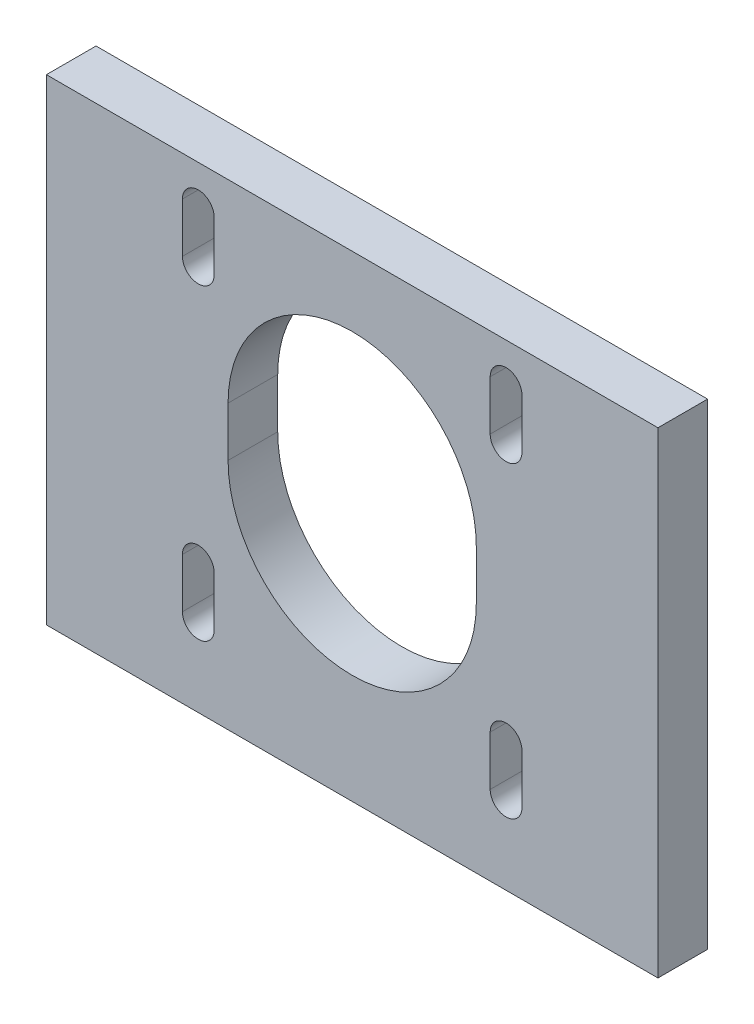
ISO-10303-21;
HEADER;
FILE_DESCRIPTION(('STEP AP214'),'2;1');
FILE_NAME('part.step','',(''),(''),'','','');
FILE_SCHEMA(('AUTOMOTIVE_DESIGN { 1 0 10303 214 1 1 1 1 }'));
ENDSEC;
DATA;
#1=APPLICATION_CONTEXT('core data for automotive mechanical design processes');
#2=APPLICATION_PROTOCOL_DEFINITION('international standard','automotive_design',2000,#1);
#3=PRODUCT_CONTEXT('',#1,'mechanical');
#4=PRODUCT('Part','Part','',(#3));
#5=PRODUCT_RELATED_PRODUCT_CATEGORY('part','',(#4));
#6=PRODUCT_DEFINITION_FORMATION('','',#4);
#7=PRODUCT_DEFINITION_CONTEXT('part definition',#1,'design');
#8=PRODUCT_DEFINITION('design','',#6,#7);
#9=PRODUCT_DEFINITION_SHAPE('','',#8);
#10=(LENGTH_UNIT() NAMED_UNIT(*) SI_UNIT(.MILLI.,.METRE.));
#11=(NAMED_UNIT(*) PLANE_ANGLE_UNIT() SI_UNIT($,.RADIAN.));
#12=(NAMED_UNIT(*) SI_UNIT($,.STERADIAN.) SOLID_ANGLE_UNIT());
#13=UNCERTAINTY_MEASURE_WITH_UNIT(LENGTH_MEASURE(1.E-05),#10,'distance_accuracy_value','');
#14=(GEOMETRIC_REPRESENTATION_CONTEXT(3) GLOBAL_UNCERTAINTY_ASSIGNED_CONTEXT((#13)) GLOBAL_UNIT_ASSIGNED_CONTEXT((#10,
#11,#12)) REPRESENTATION_CONTEXT('',''));
#15=CARTESIAN_POINT('',(0.,0.,0.));
#16=DIRECTION('',(0.,0.,1.));
#17=DIRECTION('',(1.,0.,0.));
#18=AXIS2_PLACEMENT_3D('',#15,#16,#17);
#19=CARTESIAN_POINT('',(30.8,10.,5.));
#20=DIRECTION('',(-1.,0.,0.));
#21=DIRECTION('',(0.,0.,1.));
#22=AXIS2_PLACEMENT_3D('',#19,#20,#21);
#23=PLANE('',#22);
#24=DIRECTION('',(0.,1.,0.));
#25=VECTOR('',#24,1.);
#26=CARTESIAN_POINT('',(30.8,10.,0.));
#27=LINE('',#26,#25);
#28=CARTESIAN_POINT('',(30.8,4.,0.));
#29=VERTEX_POINT('',#28);
#30=CARTESIAN_POINT('',(30.8,52.,0.));
#31=VERTEX_POINT('',#30);
#32=EDGE_CURVE('E194',#29,#31,#27,.T.);
#33=ORIENTED_EDGE('',*,*,#32,.T.);
#34=DIRECTION('',(0.,0.,-1.));
#35=VECTOR('',#34,1.);
#36=CARTESIAN_POINT('',(30.8,52.,5.));
#37=LINE('',#36,#35);
#38=CARTESIAN_POINT('',(30.8,52.,5.));
#39=VERTEX_POINT('',#38);
#40=EDGE_CURVE('E11',#39,#31,#37,.T.);
#41=ORIENTED_EDGE('',*,*,#40,.F.);
#42=DIRECTION('',(0.,1.,0.));
#43=VECTOR('',#42,1.);
#44=CARTESIAN_POINT('',(30.8,10.,5.));
#45=LINE('',#44,#43);
#46=CARTESIAN_POINT('',(30.8,4.,5.));
#47=VERTEX_POINT('',#46);
#48=EDGE_CURVE('E209',#47,#39,#45,.T.);
#49=ORIENTED_EDGE('',*,*,#48,.F.);
#50=DIRECTION('',(0.,0.,1.));
#51=VECTOR('',#50,1.);
#52=CARTESIAN_POINT('',(30.8,4.,-61.8915179972183));
#53=LINE('',#52,#51);
#54=EDGE_CURVE('E207',#29,#47,#53,.T.);
#55=ORIENTED_EDGE('',*,*,#54,.F.);
#56=EDGE_LOOP('',(#33,#41,#49,#55));
#57=FACE_BOUND('',#56,.T.);
#58=ADVANCED_FACE('F34',(#57),#23,.F.);
#59=CARTESIAN_POINT('',(-30.8,52.,5.));
#60=DIRECTION('',(0.,-1.,0.));
#61=DIRECTION('',(0.,0.,-1.));
#62=AXIS2_PLACEMENT_3D('',#59,#60,#61);
#63=PLANE('',#62);
#64=DIRECTION('',(-1.,0.,0.));
#65=VECTOR('',#64,1.);
#66=CARTESIAN_POINT('',(-30.8,52.,0.));
#67=LINE('',#66,#65);
#68=CARTESIAN_POINT('',(-30.8,52.,0.));
#69=VERTEX_POINT('',#68);
#70=EDGE_CURVE('E201',#31,#69,#67,.T.);
#71=ORIENTED_EDGE('',*,*,#70,.T.);
#72=DIRECTION('',(0.,0.,-1.));
#73=VECTOR('',#72,1.);
#74=CARTESIAN_POINT('',(-30.8,52.,5.));
#75=LINE('',#74,#73);
#76=CARTESIAN_POINT('',(-30.8,52.,5.));
#77=VERTEX_POINT('',#76);
#78=EDGE_CURVE('E41',#77,#69,#75,.T.);
#79=ORIENTED_EDGE('',*,*,#78,.F.);
#80=DIRECTION('',(-1.,0.,0.));
#81=VECTOR('',#80,1.);
#82=CARTESIAN_POINT('',(-30.8,52.,5.));
#83=LINE('',#82,#81);
#84=EDGE_CURVE('E378',#39,#77,#83,.T.);
#85=ORIENTED_EDGE('',*,*,#84,.F.);
#86=ORIENTED_EDGE('',*,*,#40,.T.);
#87=EDGE_LOOP('',(#71,#79,#85,#86));
#88=FACE_BOUND('',#87,.T.);
#89=ADVANCED_FACE('F390',(#88),#63,.F.);
#90=CARTESIAN_POINT('',(-30.8,10.,5.));
#91=DIRECTION('',(1.,0.,0.));
#92=DIRECTION('',(0.,0.,-1.));
#93=AXIS2_PLACEMENT_3D('',#90,#91,#92);
#94=PLANE('',#93);
#95=DIRECTION('',(0.,-1.,0.));
#96=VECTOR('',#95,1.);
#97=CARTESIAN_POINT('',(-30.8,10.,0.));
#98=LINE('',#97,#96);
#99=CARTESIAN_POINT('',(-30.8,4.,0.));
#100=VERTEX_POINT('',#99);
#101=EDGE_CURVE('E379',#69,#100,#98,.T.);
#102=ORIENTED_EDGE('',*,*,#101,.T.);
#103=DIRECTION('',(0.,0.,1.));
#104=VECTOR('',#103,1.);
#105=CARTESIAN_POINT('',(-30.8,4.,-61.8915179972183));
#106=LINE('',#105,#104);
#107=CARTESIAN_POINT('',(-30.8,4.,5.));
#108=VERTEX_POINT('',#107);
#109=EDGE_CURVE('E213',#100,#108,#106,.T.);
#110=ORIENTED_EDGE('',*,*,#109,.T.);
#111=DIRECTION('',(0.,-1.,0.));
#112=VECTOR('',#111,1.);
#113=CARTESIAN_POINT('',(-30.8,10.,5.));
#114=LINE('',#113,#112);
#115=EDGE_CURVE('E381',#77,#108,#114,.T.);
#116=ORIENTED_EDGE('',*,*,#115,.F.);
#117=ORIENTED_EDGE('',*,*,#78,.T.);
#118=EDGE_LOOP('',(#102,#110,#116,#117));
#119=FACE_BOUND('',#118,.T.);
#120=ADVANCED_FACE('F388',(#119),#94,.F.);
#121=CARTESIAN_POINT('',(0.,0.,5.));
#122=DIRECTION('',(0.,0.,-1.));
#123=DIRECTION('',(-1.,0.,0.));
#124=AXIS2_PLACEMENT_3D('',#121,#122,#123);
#125=PLANE('',#124);
#126=DIRECTION('',(0.,-1.,0.));
#127=VECTOR('',#126,1.);
#128=CARTESIAN_POINT('',(13.9,45.5,5.));
#129=LINE('',#128,#127);
#130=CARTESIAN_POINT('',(13.9,48.,5.));
#131=VERTEX_POINT('',#130);
#132=CARTESIAN_POINT('',(13.9,43.,5.));
#133=VERTEX_POINT('',#132);
#134=EDGE_CURVE('E333',#131,#133,#129,.T.);
#135=ORIENTED_EDGE('',*,*,#134,.F.);
#136=CARTESIAN_POINT('',(15.5,48.,5.));
#137=DIRECTION('',(0.,0.,1.));
#138=DIRECTION('',(-1.,0.,0.));
#139=AXIS2_PLACEMENT_3D('',#136,#137,#138);
#140=CIRCLE('',#139,1.6);
#141=CARTESIAN_POINT('',(17.1,48.,5.));
#142=VERTEX_POINT('',#141);
#143=EDGE_CURVE('E48',#142,#131,#140,.T.);
#144=ORIENTED_EDGE('',*,*,#143,.F.);
#145=DIRECTION('',(0.,1.,0.));
#146=VECTOR('',#145,1.);
#147=CARTESIAN_POINT('',(17.1,45.5,5.));
#148=LINE('',#147,#146);
#149=CARTESIAN_POINT('',(17.1,43.,5.));
#150=VERTEX_POINT('',#149);
#151=EDGE_CURVE('E322',#150,#142,#148,.T.);
#152=ORIENTED_EDGE('',*,*,#151,.F.);
#153=CARTESIAN_POINT('',(15.5,43.,5.));
#154=DIRECTION('',(0.,0.,1.));
#155=DIRECTION('',(-1.,0.,0.));
#156=AXIS2_PLACEMENT_3D('',#153,#154,#155);
#157=CIRCLE('',#156,1.6);
#158=EDGE_CURVE('E336',#133,#150,#157,.T.);
#159=ORIENTED_EDGE('',*,*,#158,.F.);
#160=EDGE_LOOP('',(#135,#144,#152,#159));
#161=FACE_BOUND('',#160,.T.);
#162=DIRECTION('',(0.,1.,0.));
#163=VECTOR('',#162,1.);
#164=CARTESIAN_POINT('',(17.1,14.5,5.));
#165=LINE('',#164,#163);
#166=CARTESIAN_POINT('',(17.1,12.,5.));
#167=VERTEX_POINT('',#166);
#168=CARTESIAN_POINT('',(17.1,17.,5.));
#169=VERTEX_POINT('',#168);
#170=EDGE_CURVE('E303',#167,#169,#165,.T.);
#171=ORIENTED_EDGE('',*,*,#170,.F.);
#172=CARTESIAN_POINT('',(15.5,12.,5.));
#173=DIRECTION('',(0.,0.,1.));
#174=DIRECTION('',(1.,0.,0.));
#175=AXIS2_PLACEMENT_3D('',#172,#173,#174);
#176=CIRCLE('',#175,1.6);
#177=CARTESIAN_POINT('',(13.9,12.,5.));
#178=VERTEX_POINT('',#177);
#179=EDGE_CURVE('E56',#178,#167,#176,.T.);
#180=ORIENTED_EDGE('',*,*,#179,.F.);
#181=DIRECTION('',(0.,-1.,0.));
#182=VECTOR('',#181,1.);
#183=CARTESIAN_POINT('',(13.9,12.,5.));
#184=LINE('',#183,#182);
#185=CARTESIAN_POINT('',(13.9,17.,5.));
#186=VERTEX_POINT('',#185);
#187=EDGE_CURVE('E292',#186,#178,#184,.T.);
#188=ORIENTED_EDGE('',*,*,#187,.F.);
#189=CARTESIAN_POINT('',(15.5,17.,5.));
#190=DIRECTION('',(0.,0.,1.));
#191=DIRECTION('',(1.,0.,0.));
#192=AXIS2_PLACEMENT_3D('',#189,#190,#191);
#193=CIRCLE('',#192,1.6);
#194=EDGE_CURVE('E307',#169,#186,#193,.T.);
#195=ORIENTED_EDGE('',*,*,#194,.F.);
#196=EDGE_LOOP('',(#171,#180,#188,#195));
#197=FACE_BOUND('',#196,.T.);
#198=DIRECTION('',(0.,-1.,0.));
#199=VECTOR('',#198,1.);
#200=CARTESIAN_POINT('',(-17.1,45.5,5.));
#201=LINE('',#200,#199);
#202=CARTESIAN_POINT('',(-17.1,48.,5.));
#203=VERTEX_POINT('',#202);
#204=CARTESIAN_POINT('',(-17.1,43.,5.));
#205=VERTEX_POINT('',#204);
#206=EDGE_CURVE('E272',#203,#205,#201,.T.);
#207=ORIENTED_EDGE('',*,*,#206,.F.);
#208=CARTESIAN_POINT('',(-15.5,48.,5.));
#209=DIRECTION('',(0.,0.,1.));
#210=DIRECTION('',(1.,0.,0.));
#211=AXIS2_PLACEMENT_3D('',#208,#209,#210);
#212=CIRCLE('',#211,1.6);
#213=CARTESIAN_POINT('',(-13.9,48.,5.));
#214=VERTEX_POINT('',#213);
#215=EDGE_CURVE('E270',#214,#203,#212,.T.);
#216=ORIENTED_EDGE('',*,*,#215,.F.);
#217=DIRECTION('',(0.,1.,0.));
#218=VECTOR('',#217,1.);
#219=CARTESIAN_POINT('',(-13.9,48.,5.));
#220=LINE('',#219,#218);
#221=CARTESIAN_POINT('',(-13.9,43.,5.));
#222=VERTEX_POINT('',#221);
#223=EDGE_CURVE('E260',#222,#214,#220,.T.);
#224=ORIENTED_EDGE('',*,*,#223,.F.);
#225=CARTESIAN_POINT('',(-15.5,43.,5.));
#226=DIRECTION('',(0.,0.,1.));
#227=DIRECTION('',(1.,0.,0.));
#228=AXIS2_PLACEMENT_3D('',#225,#226,#227);
#229=CIRCLE('',#228,1.6);
#230=EDGE_CURVE('E276',#205,#222,#229,.T.);
#231=ORIENTED_EDGE('',*,*,#230,.F.);
#232=EDGE_LOOP('',(#207,#216,#224,#231));
#233=FACE_BOUND('',#232,.T.);
#234=DIRECTION('',(0.,1.,0.));
#235=VECTOR('',#234,1.);
#236=CARTESIAN_POINT('',(-13.9,14.5,5.));
#237=LINE('',#236,#235);
#238=CARTESIAN_POINT('',(-13.9,12.,5.));
#239=VERTEX_POINT('',#238);
#240=CARTESIAN_POINT('',(-13.9,17.,5.));
#241=VERTEX_POINT('',#240);
#242=EDGE_CURVE('E238',#239,#241,#237,.T.);
#243=ORIENTED_EDGE('',*,*,#242,.F.);
#244=CARTESIAN_POINT('',(-15.5,12.,5.));
#245=DIRECTION('',(0.,0.,1.));
#246=DIRECTION('',(-1.,0.,0.));
#247=AXIS2_PLACEMENT_3D('',#244,#245,#246);
#248=CIRCLE('',#247,1.6);
#249=CARTESIAN_POINT('',(-17.1,12.,5.));
#250=VERTEX_POINT('',#249);
#251=EDGE_CURVE('E236',#250,#239,#248,.T.);
#252=ORIENTED_EDGE('',*,*,#251,.F.);
#253=DIRECTION('',(0.,-1.,0.));
#254=VECTOR('',#253,1.);
#255=CARTESIAN_POINT('',(-17.1,14.5,5.));
#256=LINE('',#255,#254);
#257=CARTESIAN_POINT('',(-17.1,17.,5.));
#258=VERTEX_POINT('',#257);
#259=EDGE_CURVE('E226',#258,#250,#256,.T.);
#260=ORIENTED_EDGE('',*,*,#259,.F.);
#261=CARTESIAN_POINT('',(-15.5,17.,5.));
#262=DIRECTION('',(0.,0.,1.));
#263=DIRECTION('',(-1.,0.,0.));
#264=AXIS2_PLACEMENT_3D('',#261,#262,#263);
#265=CIRCLE('',#264,1.6);
#266=EDGE_CURVE('E242',#241,#258,#265,.T.);
#267=ORIENTED_EDGE('',*,*,#266,.F.);
#268=EDGE_LOOP('',(#243,#252,#260,#267));
#269=FACE_BOUND('',#268,.T.);
#270=DIRECTION('',(0.,-1.,0.));
#271=VECTOR('',#270,1.);
#272=CARTESIAN_POINT('',(-12.5,27.4999999999999,5.));
#273=LINE('',#272,#271);
#274=CARTESIAN_POINT('',(-12.5,32.5000000000001,5.));
#275=VERTEX_POINT('',#274);
#276=CARTESIAN_POINT('',(-12.5,27.4999999999999,5.));
#277=VERTEX_POINT('',#276);
#278=EDGE_CURVE('E362',#275,#277,#273,.T.);
#279=ORIENTED_EDGE('',*,*,#278,.F.);
#280=CARTESIAN_POINT('',(0.,32.5,5.));
#281=DIRECTION('',(0.,0.,1.));
#282=DIRECTION('',(-1.,0.,0.));
#283=AXIS2_PLACEMENT_3D('',#280,#281,#282);
#284=CIRCLE('',#283,12.5);
#285=CARTESIAN_POINT('',(12.5,32.4999999999999,5.));
#286=VERTEX_POINT('',#285);
#287=EDGE_CURVE('E249',#286,#275,#284,.T.);
#288=ORIENTED_EDGE('',*,*,#287,.F.);
#289=DIRECTION('',(0.,1.,0.));
#290=VECTOR('',#289,1.);
#291=CARTESIAN_POINT('',(12.5,27.5000000000001,5.));
#292=LINE('',#291,#290);
#293=CARTESIAN_POINT('',(12.5,27.5000000000001,5.));
#294=VERTEX_POINT('',#293);
#295=EDGE_CURVE('E351',#294,#286,#292,.T.);
#296=ORIENTED_EDGE('',*,*,#295,.F.);
#297=CARTESIAN_POINT('',(0.,27.5,5.));
#298=DIRECTION('',(0.,0.,1.));
#299=DIRECTION('',(1.,0.,0.));
#300=AXIS2_PLACEMENT_3D('',#297,#298,#299);
#301=CIRCLE('',#300,12.5);
#302=EDGE_CURVE('E365',#277,#294,#301,.T.);
#303=ORIENTED_EDGE('',*,*,#302,.F.);
#304=EDGE_LOOP('',(#279,#288,#296,#303));
#305=FACE_BOUND('',#304,.T.);
#306=ORIENTED_EDGE('',*,*,#48,.T.);
#307=ORIENTED_EDGE('',*,*,#84,.T.);
#308=ORIENTED_EDGE('',*,*,#115,.T.);
#309=DIRECTION('',(1.,0.,0.));
#310=VECTOR('',#309,1.);
#311=CARTESIAN_POINT('',(30.8,4.,5.));
#312=LINE('',#311,#310);
#313=EDGE_CURVE('E217',#108,#47,#312,.T.);
#314=ORIENTED_EDGE('',*,*,#313,.T.);
#315=EDGE_LOOP('',(#306,#307,#308,#314));
#316=FACE_BOUND('',#315,.T.);
#317=ADVANCED_FACE('F392',(#161,#197,#233,#269,#305,#316),#125,.F.);
#318=CARTESIAN_POINT('',(0.,0.,0.));
#319=DIRECTION('',(0.,0.,-1.));
#320=DIRECTION('',(-1.,0.,0.));
#321=AXIS2_PLACEMENT_3D('',#318,#319,#320);
#322=PLANE('',#321);
#323=CARTESIAN_POINT('',(15.5,48.,0.));
#324=DIRECTION('',(0.,0.,1.));
#325=DIRECTION('',(-1.,0.,0.));
#326=AXIS2_PLACEMENT_3D('',#323,#324,#325);
#327=CIRCLE('',#326,1.6);
#328=CARTESIAN_POINT('',(17.1,48.,0.));
#329=VERTEX_POINT('',#328);
#330=CARTESIAN_POINT('',(13.9,48.,0.));
#331=VERTEX_POINT('',#330);
#332=EDGE_CURVE('E318',#329,#331,#327,.T.);
#333=ORIENTED_EDGE('',*,*,#332,.T.);
#334=DIRECTION('',(0.,-1.,0.));
#335=VECTOR('',#334,1.);
#336=CARTESIAN_POINT('',(13.9,48.,0.));
#337=LINE('',#336,#335);
#338=CARTESIAN_POINT('',(13.9,43.,0.));
#339=VERTEX_POINT('',#338);
#340=EDGE_CURVE('E321',#331,#339,#337,.T.);
#341=ORIENTED_EDGE('',*,*,#340,.T.);
#342=CARTESIAN_POINT('',(15.5,43.,0.));
#343=DIRECTION('',(0.,0.,1.));
#344=DIRECTION('',(-1.,0.,0.));
#345=AXIS2_PLACEMENT_3D('',#342,#343,#344);
#346=CIRCLE('',#345,1.6);
#347=CARTESIAN_POINT('',(17.1,43.,0.));
#348=VERTEX_POINT('',#347);
#349=EDGE_CURVE('E325',#339,#348,#346,.T.);
#350=ORIENTED_EDGE('',*,*,#349,.T.);
#351=DIRECTION('',(0.,1.,0.));
#352=VECTOR('',#351,1.);
#353=CARTESIAN_POINT('',(17.1,45.5,0.));
#354=LINE('',#353,#352);
#355=EDGE_CURVE('E328',#348,#329,#354,.T.);
#356=ORIENTED_EDGE('',*,*,#355,.T.);
#357=EDGE_LOOP('',(#333,#341,#350,#356));
#358=FACE_BOUND('',#357,.T.);
#359=CARTESIAN_POINT('',(15.5,12.,0.));
#360=DIRECTION('',(0.,0.,1.));
#361=DIRECTION('',(1.,0.,0.));
#362=AXIS2_PLACEMENT_3D('',#359,#360,#361);
#363=CIRCLE('',#362,1.6);
#364=CARTESIAN_POINT('',(13.9,12.,0.));
#365=VERTEX_POINT('',#364);
#366=CARTESIAN_POINT('',(17.1,12.,0.));
#367=VERTEX_POINT('',#366);
#368=EDGE_CURVE('E288',#365,#367,#363,.T.);
#369=ORIENTED_EDGE('',*,*,#368,.T.);
#370=DIRECTION('',(0.,1.,0.));
#371=VECTOR('',#370,1.);
#372=CARTESIAN_POINT('',(17.1,14.5,0.));
#373=LINE('',#372,#371);
#374=CARTESIAN_POINT('',(17.1,17.,0.));
#375=VERTEX_POINT('',#374);
#376=EDGE_CURVE('E291',#367,#375,#373,.T.);
#377=ORIENTED_EDGE('',*,*,#376,.T.);
#378=CARTESIAN_POINT('',(15.5,17.,0.));
#379=DIRECTION('',(0.,0.,1.));
#380=DIRECTION('',(1.,0.,0.));
#381=AXIS2_PLACEMENT_3D('',#378,#379,#380);
#382=CIRCLE('',#381,1.6);
#383=CARTESIAN_POINT('',(13.9,17.,0.));
#384=VERTEX_POINT('',#383);
#385=EDGE_CURVE('E295',#375,#384,#382,.T.);
#386=ORIENTED_EDGE('',*,*,#385,.T.);
#387=DIRECTION('',(0.,-1.,0.));
#388=VECTOR('',#387,1.);
#389=CARTESIAN_POINT('',(13.9,14.5,0.));
#390=LINE('',#389,#388);
#391=EDGE_CURVE('E298',#384,#365,#390,.T.);
#392=ORIENTED_EDGE('',*,*,#391,.T.);
#393=EDGE_LOOP('',(#369,#377,#386,#392));
#394=FACE_BOUND('',#393,.T.);
#395=CARTESIAN_POINT('',(-15.5,48.,0.));
#396=DIRECTION('',(0.,0.,1.));
#397=DIRECTION('',(1.,0.,0.));
#398=AXIS2_PLACEMENT_3D('',#395,#396,#397);
#399=CIRCLE('',#398,1.6);
#400=CARTESIAN_POINT('',(-13.9,48.,0.));
#401=VERTEX_POINT('',#400);
#402=CARTESIAN_POINT('',(-17.1,48.,0.));
#403=VERTEX_POINT('',#402);
#404=EDGE_CURVE('E256',#401,#403,#399,.T.);
#405=ORIENTED_EDGE('',*,*,#404,.T.);
#406=DIRECTION('',(0.,-1.,0.));
#407=VECTOR('',#406,1.);
#408=CARTESIAN_POINT('',(-17.1,45.5,0.));
#409=LINE('',#408,#407);
#410=CARTESIAN_POINT('',(-17.1,43.,0.));
#411=VERTEX_POINT('',#410);
#412=EDGE_CURVE('E259',#403,#411,#409,.T.);
#413=ORIENTED_EDGE('',*,*,#412,.T.);
#414=CARTESIAN_POINT('',(-15.5,43.,0.));
#415=DIRECTION('',(0.,0.,1.));
#416=DIRECTION('',(1.,0.,0.));
#417=AXIS2_PLACEMENT_3D('',#414,#415,#416);
#418=CIRCLE('',#417,1.6);
#419=CARTESIAN_POINT('',(-13.9,43.,0.));
#420=VERTEX_POINT('',#419);
#421=EDGE_CURVE('E263',#411,#420,#418,.T.);
#422=ORIENTED_EDGE('',*,*,#421,.T.);
#423=DIRECTION('',(0.,1.,0.));
#424=VECTOR('',#423,1.);
#425=CARTESIAN_POINT('',(-13.9,45.5,0.));
#426=LINE('',#425,#424);
#427=EDGE_CURVE('E266',#420,#401,#426,.T.);
#428=ORIENTED_EDGE('',*,*,#427,.T.);
#429=EDGE_LOOP('',(#405,#413,#422,#428));
#430=FACE_BOUND('',#429,.T.);
#431=CARTESIAN_POINT('',(-15.5,12.,0.));
#432=DIRECTION('',(0.,0.,1.));
#433=DIRECTION('',(-1.,0.,0.));
#434=AXIS2_PLACEMENT_3D('',#431,#432,#433);
#435=CIRCLE('',#434,1.6);
#436=CARTESIAN_POINT('',(-17.1,12.,0.));
#437=VERTEX_POINT('',#436);
#438=CARTESIAN_POINT('',(-13.9,12.,0.));
#439=VERTEX_POINT('',#438);
#440=EDGE_CURVE('E222',#437,#439,#435,.T.);
#441=ORIENTED_EDGE('',*,*,#440,.T.);
#442=DIRECTION('',(0.,1.,0.));
#443=VECTOR('',#442,1.);
#444=CARTESIAN_POINT('',(-13.9,12.,0.));
#445=LINE('',#444,#443);
#446=CARTESIAN_POINT('',(-13.9,17.,0.));
#447=VERTEX_POINT('',#446);
#448=EDGE_CURVE('E225',#439,#447,#445,.T.);
#449=ORIENTED_EDGE('',*,*,#448,.T.);
#450=CARTESIAN_POINT('',(-15.5,17.,0.));
#451=DIRECTION('',(0.,0.,1.));
#452=DIRECTION('',(-1.,0.,0.));
#453=AXIS2_PLACEMENT_3D('',#450,#451,#452);
#454=CIRCLE('',#453,1.6);
#455=CARTESIAN_POINT('',(-17.1,17.,0.));
#456=VERTEX_POINT('',#455);
#457=EDGE_CURVE('E229',#447,#456,#454,.T.);
#458=ORIENTED_EDGE('',*,*,#457,.T.);
#459=DIRECTION('',(0.,-1.,0.));
#460=VECTOR('',#459,1.);
#461=CARTESIAN_POINT('',(-17.1,14.5,0.));
#462=LINE('',#461,#460);
#463=EDGE_CURVE('E232',#456,#437,#462,.T.);
#464=ORIENTED_EDGE('',*,*,#463,.T.);
#465=EDGE_LOOP('',(#441,#449,#458,#464));
#466=FACE_BOUND('',#465,.T.);
#467=CARTESIAN_POINT('',(0.,32.5,0.));
#468=DIRECTION('',(0.,0.,1.));
#469=DIRECTION('',(-1.,0.,0.));
#470=AXIS2_PLACEMENT_3D('',#467,#468,#469);
#471=CIRCLE('',#470,12.5);
#472=CARTESIAN_POINT('',(12.5,32.4999999999999,0.));
#473=VERTEX_POINT('',#472);
#474=CARTESIAN_POINT('',(-12.5,32.5000000000001,0.));
#475=VERTEX_POINT('',#474);
#476=EDGE_CURVE('E347',#473,#475,#471,.T.);
#477=ORIENTED_EDGE('',*,*,#476,.T.);
#478=DIRECTION('',(0.,-1.,0.));
#479=VECTOR('',#478,1.);
#480=CARTESIAN_POINT('',(-12.5,27.4999999999999,0.));
#481=LINE('',#480,#479);
#482=CARTESIAN_POINT('',(-12.5,27.4999999999999,0.));
#483=VERTEX_POINT('',#482);
#484=EDGE_CURVE('E350',#475,#483,#481,.T.);
#485=ORIENTED_EDGE('',*,*,#484,.T.);
#486=CARTESIAN_POINT('',(0.,27.5,0.));
#487=DIRECTION('',(0.,0.,1.));
#488=DIRECTION('',(1.,0.,0.));
#489=AXIS2_PLACEMENT_3D('',#486,#487,#488);
#490=CIRCLE('',#489,12.5);
#491=CARTESIAN_POINT('',(12.5,27.5000000000001,0.));
#492=VERTEX_POINT('',#491);
#493=EDGE_CURVE('E354',#483,#492,#490,.T.);
#494=ORIENTED_EDGE('',*,*,#493,.T.);
#495=DIRECTION('',(0.,1.,0.));
#496=VECTOR('',#495,1.);
#497=CARTESIAN_POINT('',(12.5,27.5000000000001,0.));
#498=LINE('',#497,#496);
#499=EDGE_CURVE('E357',#492,#473,#498,.T.);
#500=ORIENTED_EDGE('',*,*,#499,.T.);
#501=EDGE_LOOP('',(#477,#485,#494,#500));
#502=FACE_BOUND('',#501,.T.);
#503=ORIENTED_EDGE('',*,*,#32,.F.);
#504=DIRECTION('',(1.,0.,0.));
#505=VECTOR('',#504,1.);
#506=CARTESIAN_POINT('',(30.8,4.,0.));
#507=LINE('',#506,#505);
#508=EDGE_CURVE('E199',#100,#29,#507,.T.);
#509=ORIENTED_EDGE('',*,*,#508,.F.);
#510=ORIENTED_EDGE('',*,*,#101,.F.);
#511=ORIENTED_EDGE('',*,*,#70,.F.);
#512=EDGE_LOOP('',(#503,#509,#510,#511));
#513=FACE_BOUND('',#512,.T.);
#514=ADVANCED_FACE('F196',(#358,#394,#430,#466,#502,#513),#322,.T.);
#515=CARTESIAN_POINT('',(0.,32.5,0.));
#516=DIRECTION('',(0.,0.,1.));
#517=DIRECTION('',(1.,0.,0.));
#518=AXIS2_PLACEMENT_3D('',#515,#516,#517);
#519=CYLINDRICAL_SURFACE('',#518,12.5);
#520=ORIENTED_EDGE('',*,*,#287,.T.);
#521=DIRECTION('',(0.,0.,1.));
#522=VECTOR('',#521,1.);
#523=CARTESIAN_POINT('',(-12.5,32.5000000000001,0.));
#524=LINE('',#523,#522);
#525=EDGE_CURVE('E360',#475,#275,#524,.T.);
#526=ORIENTED_EDGE('',*,*,#525,.F.);
#527=ORIENTED_EDGE('',*,*,#476,.F.);
#528=DIRECTION('',(0.,0.,1.));
#529=VECTOR('',#528,1.);
#530=CARTESIAN_POINT('',(12.5,32.4999999999999,0.));
#531=LINE('',#530,#529);
#532=EDGE_CURVE('E204',#473,#286,#531,.T.);
#533=ORIENTED_EDGE('',*,*,#532,.T.);
#534=EDGE_LOOP('',(#520,#526,#527,#533));
#535=FACE_BOUND('',#534,.T.);
#536=ADVANCED_FACE('F400',(#535),#519,.F.);
#537=CARTESIAN_POINT('',(12.5,27.5000000000001,0.));
#538=DIRECTION('',(1.,0.,0.));
#539=DIRECTION('',(0.,0.,-1.));
#540=AXIS2_PLACEMENT_3D('',#537,#538,#539);
#541=PLANE('',#540);
#542=ORIENTED_EDGE('',*,*,#295,.T.);
#543=ORIENTED_EDGE('',*,*,#532,.F.);
#544=ORIENTED_EDGE('',*,*,#499,.F.);
#545=DIRECTION('',(0.,0.,1.));
#546=VECTOR('',#545,1.);
#547=CARTESIAN_POINT('',(12.5,27.5000000000001,0.));
#548=LINE('',#547,#546);
#549=EDGE_CURVE('E371',#492,#294,#548,.T.);
#550=ORIENTED_EDGE('',*,*,#549,.T.);
#551=EDGE_LOOP('',(#542,#543,#544,#550));
#552=FACE_BOUND('',#551,.T.);
#553=ADVANCED_FACE('F585',(#552),#541,.F.);
#554=CARTESIAN_POINT('',(0.,27.5,0.));
#555=DIRECTION('',(0.,0.,1.));
#556=DIRECTION('',(1.,0.,0.));
#557=AXIS2_PLACEMENT_3D('',#554,#555,#556);
#558=CYLINDRICAL_SURFACE('',#557,12.5);
#559=ORIENTED_EDGE('',*,*,#302,.T.);
#560=ORIENTED_EDGE('',*,*,#549,.F.);
#561=ORIENTED_EDGE('',*,*,#493,.F.);
#562=DIRECTION('',(0.,0.,1.));
#563=VECTOR('',#562,1.);
#564=CARTESIAN_POINT('',(-12.5,27.4999999999999,0.));
#565=LINE('',#564,#563);
#566=EDGE_CURVE('E373',#483,#277,#565,.T.);
#567=ORIENTED_EDGE('',*,*,#566,.T.);
#568=EDGE_LOOP('',(#559,#560,#561,#567));
#569=FACE_BOUND('',#568,.T.);
#570=ADVANCED_FACE('F577',(#569),#558,.F.);
#571=CARTESIAN_POINT('',(-12.5,27.4999999999999,0.));
#572=DIRECTION('',(-1.,0.,0.));
#573=DIRECTION('',(0.,0.,1.));
#574=AXIS2_PLACEMENT_3D('',#571,#572,#573);
#575=PLANE('',#574);
#576=ORIENTED_EDGE('',*,*,#278,.T.);
#577=ORIENTED_EDGE('',*,*,#566,.F.);
#578=ORIENTED_EDGE('',*,*,#484,.F.);
#579=ORIENTED_EDGE('',*,*,#525,.T.);
#580=EDGE_LOOP('',(#576,#577,#578,#579));
#581=FACE_BOUND('',#580,.T.);
#582=ADVANCED_FACE('F569',(#581),#575,.F.);
#583=CARTESIAN_POINT('',(-15.5,12.,0.));
#584=DIRECTION('',(0.,0.,1.));
#585=DIRECTION('',(1.,0.,0.));
#586=AXIS2_PLACEMENT_3D('',#583,#584,#585);
#587=CYLINDRICAL_SURFACE('',#586,1.6);
#588=ORIENTED_EDGE('',*,*,#251,.T.);
#589=DIRECTION('',(0.,0.,1.));
#590=VECTOR('',#589,1.);
#591=CARTESIAN_POINT('',(-13.9,12.,0.));
#592=LINE('',#591,#590);
#593=EDGE_CURVE('E235',#439,#239,#592,.T.);
#594=ORIENTED_EDGE('',*,*,#593,.F.);
#595=ORIENTED_EDGE('',*,*,#440,.F.);
#596=DIRECTION('',(0.,0.,1.));
#597=VECTOR('',#596,1.);
#598=CARTESIAN_POINT('',(-17.1,12.,0.));
#599=LINE('',#598,#597);
#600=EDGE_CURVE('E247',#437,#250,#599,.T.);
#601=ORIENTED_EDGE('',*,*,#600,.T.);
#602=EDGE_LOOP('',(#588,#594,#595,#601));
#603=FACE_BOUND('',#602,.T.);
#604=ADVANCED_FACE('F561',(#603),#587,.F.);
#605=CARTESIAN_POINT('',(-17.1,14.5,0.));
#606=DIRECTION('',(-1.,0.,0.));
#607=DIRECTION('',(0.,0.,1.));
#608=AXIS2_PLACEMENT_3D('',#605,#606,#607);
#609=PLANE('',#608);
#610=ORIENTED_EDGE('',*,*,#259,.T.);
#611=ORIENTED_EDGE('',*,*,#600,.F.);
#612=ORIENTED_EDGE('',*,*,#463,.F.);
#613=DIRECTION('',(0.,0.,1.));
#614=VECTOR('',#613,1.);
#615=CARTESIAN_POINT('',(-17.1,17.,0.));
#616=LINE('',#615,#614);
#617=EDGE_CURVE('E250',#456,#258,#616,.T.);
#618=ORIENTED_EDGE('',*,*,#617,.T.);
#619=EDGE_LOOP('',(#610,#611,#612,#618));
#620=FACE_BOUND('',#619,.T.);
#621=ADVANCED_FACE('F553',(#620),#609,.F.);
#622=CARTESIAN_POINT('',(-15.5,17.,0.));
#623=DIRECTION('',(0.,0.,1.));
#624=DIRECTION('',(1.,0.,0.));
#625=AXIS2_PLACEMENT_3D('',#622,#623,#624);
#626=CYLINDRICAL_SURFACE('',#625,1.6);
#627=ORIENTED_EDGE('',*,*,#266,.T.);
#628=ORIENTED_EDGE('',*,*,#617,.F.);
#629=ORIENTED_EDGE('',*,*,#457,.F.);
#630=DIRECTION('',(0.,0.,1.));
#631=VECTOR('',#630,1.);
#632=CARTESIAN_POINT('',(-13.9,17.,0.));
#633=LINE('',#632,#631);
#634=EDGE_CURVE('E252',#447,#241,#633,.T.);
#635=ORIENTED_EDGE('',*,*,#634,.T.);
#636=EDGE_LOOP('',(#627,#628,#629,#635));
#637=FACE_BOUND('',#636,.T.);
#638=ADVANCED_FACE('F545',(#637),#626,.F.);
#639=CARTESIAN_POINT('',(-13.9,14.5,0.));
#640=DIRECTION('',(1.,0.,0.));
#641=DIRECTION('',(0.,0.,-1.));
#642=AXIS2_PLACEMENT_3D('',#639,#640,#641);
#643=PLANE('',#642);
#644=ORIENTED_EDGE('',*,*,#242,.T.);
#645=ORIENTED_EDGE('',*,*,#634,.F.);
#646=ORIENTED_EDGE('',*,*,#448,.F.);
#647=ORIENTED_EDGE('',*,*,#593,.T.);
#648=EDGE_LOOP('',(#644,#645,#646,#647));
#649=FACE_BOUND('',#648,.T.);
#650=ADVANCED_FACE('F537',(#649),#643,.F.);
#651=CARTESIAN_POINT('',(-15.5,48.,0.));
#652=DIRECTION('',(0.,0.,1.));
#653=DIRECTION('',(1.,0.,0.));
#654=AXIS2_PLACEMENT_3D('',#651,#652,#653);
#655=CYLINDRICAL_SURFACE('',#654,1.6);
#656=ORIENTED_EDGE('',*,*,#215,.T.);
#657=DIRECTION('',(0.,0.,1.));
#658=VECTOR('',#657,1.);
#659=CARTESIAN_POINT('',(-17.1,48.,0.));
#660=LINE('',#659,#658);
#661=EDGE_CURVE('E269',#403,#203,#660,.T.);
#662=ORIENTED_EDGE('',*,*,#661,.F.);
#663=ORIENTED_EDGE('',*,*,#404,.F.);
#664=DIRECTION('',(0.,0.,1.));
#665=VECTOR('',#664,1.);
#666=CARTESIAN_POINT('',(-13.9,48.,0.));
#667=LINE('',#666,#665);
#668=EDGE_CURVE('E239',#401,#214,#667,.T.);
#669=ORIENTED_EDGE('',*,*,#668,.T.);
#670=EDGE_LOOP('',(#656,#662,#663,#669));
#671=FACE_BOUND('',#670,.T.);
#672=ADVANCED_FACE('F529',(#671),#655,.F.);
#673=CARTESIAN_POINT('',(-13.9,48.,0.));
#674=DIRECTION('',(1.,0.,0.));
#675=DIRECTION('',(0.,0.,-1.));
#676=AXIS2_PLACEMENT_3D('',#673,#674,#675);
#677=PLANE('',#676);
#678=ORIENTED_EDGE('',*,*,#223,.T.);
#679=ORIENTED_EDGE('',*,*,#668,.F.);
#680=ORIENTED_EDGE('',*,*,#427,.F.);
#681=DIRECTION('',(0.,0.,1.));
#682=VECTOR('',#681,1.);
#683=CARTESIAN_POINT('',(-13.9,43.,0.));
#684=LINE('',#683,#682);
#685=EDGE_CURVE('E282',#420,#222,#684,.T.);
#686=ORIENTED_EDGE('',*,*,#685,.T.);
#687=EDGE_LOOP('',(#678,#679,#680,#686));
#688=FACE_BOUND('',#687,.T.);
#689=ADVANCED_FACE('F521',(#688),#677,.F.);
#690=CARTESIAN_POINT('',(-15.5,43.,0.));
#691=DIRECTION('',(0.,0.,1.));
#692=DIRECTION('',(1.,0.,0.));
#693=AXIS2_PLACEMENT_3D('',#690,#691,#692);
#694=CYLINDRICAL_SURFACE('',#693,1.6);
#695=ORIENTED_EDGE('',*,*,#230,.T.);
#696=ORIENTED_EDGE('',*,*,#685,.F.);
#697=ORIENTED_EDGE('',*,*,#421,.F.);
#698=DIRECTION('',(0.,0.,1.));
#699=VECTOR('',#698,1.);
#700=CARTESIAN_POINT('',(-17.1,43.,0.));
#701=LINE('',#700,#699);
#702=EDGE_CURVE('E284',#411,#205,#701,.T.);
#703=ORIENTED_EDGE('',*,*,#702,.T.);
#704=EDGE_LOOP('',(#695,#696,#697,#703));
#705=FACE_BOUND('',#704,.T.);
#706=ADVANCED_FACE('F513',(#705),#694,.F.);
#707=CARTESIAN_POINT('',(-17.1,45.5,0.));
#708=DIRECTION('',(-1.,0.,0.));
#709=DIRECTION('',(0.,0.,1.));
#710=AXIS2_PLACEMENT_3D('',#707,#708,#709);
#711=PLANE('',#710);
#712=ORIENTED_EDGE('',*,*,#206,.T.);
#713=ORIENTED_EDGE('',*,*,#702,.F.);
#714=ORIENTED_EDGE('',*,*,#412,.F.);
#715=ORIENTED_EDGE('',*,*,#661,.T.);
#716=EDGE_LOOP('',(#712,#713,#714,#715));
#717=FACE_BOUND('',#716,.T.);
#718=ADVANCED_FACE('F506',(#717),#711,.F.);
#719=CARTESIAN_POINT('',(15.5,12.,0.));
#720=DIRECTION('',(0.,0.,1.));
#721=DIRECTION('',(1.,0.,0.));
#722=AXIS2_PLACEMENT_3D('',#719,#720,#721);
#723=CYLINDRICAL_SURFACE('',#722,1.6);
#724=ORIENTED_EDGE('',*,*,#179,.T.);
#725=DIRECTION('',(0.,0.,1.));
#726=VECTOR('',#725,1.);
#727=CARTESIAN_POINT('',(17.1,12.,0.));
#728=LINE('',#727,#726);
#729=EDGE_CURVE('E301',#367,#167,#728,.T.);
#730=ORIENTED_EDGE('',*,*,#729,.F.);
#731=ORIENTED_EDGE('',*,*,#368,.F.);
#732=DIRECTION('',(0.,0.,1.));
#733=VECTOR('',#732,1.);
#734=CARTESIAN_POINT('',(13.9,12.,0.));
#735=LINE('',#734,#733);
#736=EDGE_CURVE('E273',#365,#178,#735,.T.);
#737=ORIENTED_EDGE('',*,*,#736,.T.);
#738=EDGE_LOOP('',(#724,#730,#731,#737));
#739=FACE_BOUND('',#738,.T.);
#740=ADVANCED_FACE('F498',(#739),#723,.F.);
#741=CARTESIAN_POINT('',(13.9,12.,0.));
#742=DIRECTION('',(-1.,0.,0.));
#743=DIRECTION('',(0.,-1.,0.));
#744=AXIS2_PLACEMENT_3D('',#741,#742,#743);
#745=PLANE('',#744);
#746=ORIENTED_EDGE('',*,*,#187,.T.);
#747=ORIENTED_EDGE('',*,*,#736,.F.);
#748=ORIENTED_EDGE('',*,*,#391,.F.);
#749=DIRECTION('',(0.,0.,1.));
#750=VECTOR('',#749,1.);
#751=CARTESIAN_POINT('',(13.9,17.,0.));
#752=LINE('',#751,#750);
#753=EDGE_CURVE('E313',#384,#186,#752,.T.);
#754=ORIENTED_EDGE('',*,*,#753,.T.);
#755=EDGE_LOOP('',(#746,#747,#748,#754));
#756=FACE_BOUND('',#755,.T.);
#757=ADVANCED_FACE('F490',(#756),#745,.F.);
#758=CARTESIAN_POINT('',(15.5,17.,0.));
#759=DIRECTION('',(0.,0.,1.));
#760=DIRECTION('',(1.,0.,0.));
#761=AXIS2_PLACEMENT_3D('',#758,#759,#760);
#762=CYLINDRICAL_SURFACE('',#761,1.6);
#763=ORIENTED_EDGE('',*,*,#194,.T.);
#764=ORIENTED_EDGE('',*,*,#753,.F.);
#765=ORIENTED_EDGE('',*,*,#385,.F.);
#766=DIRECTION('',(0.,0.,1.));
#767=VECTOR('',#766,1.);
#768=CARTESIAN_POINT('',(17.1,17.,0.));
#769=LINE('',#768,#767);
#770=EDGE_CURVE('E315',#375,#169,#769,.T.);
#771=ORIENTED_EDGE('',*,*,#770,.T.);
#772=EDGE_LOOP('',(#763,#764,#765,#771));
#773=FACE_BOUND('',#772,.T.);
#774=ADVANCED_FACE('F482',(#773),#762,.F.);
#775=CARTESIAN_POINT('',(17.1,14.5,0.));
#776=DIRECTION('',(1.,0.,0.));
#777=DIRECTION('',(0.,1.,0.));
#778=AXIS2_PLACEMENT_3D('',#775,#776,#777);
#779=PLANE('',#778);
#780=ORIENTED_EDGE('',*,*,#170,.T.);
#781=ORIENTED_EDGE('',*,*,#770,.F.);
#782=ORIENTED_EDGE('',*,*,#376,.F.);
#783=ORIENTED_EDGE('',*,*,#729,.T.);
#784=EDGE_LOOP('',(#780,#781,#782,#783));
#785=FACE_BOUND('',#784,.T.);
#786=ADVANCED_FACE('F475',(#785),#779,.F.);
#787=CARTESIAN_POINT('',(15.5,48.,0.));
#788=DIRECTION('',(0.,0.,1.));
#789=DIRECTION('',(1.,0.,0.));
#790=AXIS2_PLACEMENT_3D('',#787,#788,#789);
#791=CYLINDRICAL_SURFACE('',#790,1.6);
#792=ORIENTED_EDGE('',*,*,#143,.T.);
#793=DIRECTION('',(0.,0.,1.));
#794=VECTOR('',#793,1.);
#795=CARTESIAN_POINT('',(13.9,48.,0.));
#796=LINE('',#795,#794);
#797=EDGE_CURVE('E331',#331,#131,#796,.T.);
#798=ORIENTED_EDGE('',*,*,#797,.F.);
#799=ORIENTED_EDGE('',*,*,#332,.F.);
#800=DIRECTION('',(0.,0.,1.));
#801=VECTOR('',#800,1.);
#802=CARTESIAN_POINT('',(17.1,48.,0.));
#803=LINE('',#802,#801);
#804=EDGE_CURVE('E304',#329,#142,#803,.T.);
#805=ORIENTED_EDGE('',*,*,#804,.T.);
#806=EDGE_LOOP('',(#792,#798,#799,#805));
#807=FACE_BOUND('',#806,.T.);
#808=ADVANCED_FACE('F467',(#807),#791,.F.);
#809=CARTESIAN_POINT('',(17.1,45.5,0.));
#810=DIRECTION('',(1.,0.,0.));
#811=DIRECTION('',(0.,1.,0.));
#812=AXIS2_PLACEMENT_3D('',#809,#810,#811);
#813=PLANE('',#812);
#814=ORIENTED_EDGE('',*,*,#151,.T.);
#815=ORIENTED_EDGE('',*,*,#804,.F.);
#816=ORIENTED_EDGE('',*,*,#355,.F.);
#817=DIRECTION('',(0.,0.,1.));
#818=VECTOR('',#817,1.);
#819=CARTESIAN_POINT('',(17.1,43.,0.));
#820=LINE('',#819,#818);
#821=EDGE_CURVE('E342',#348,#150,#820,.T.);
#822=ORIENTED_EDGE('',*,*,#821,.T.);
#823=EDGE_LOOP('',(#814,#815,#816,#822));
#824=FACE_BOUND('',#823,.T.);
#825=ADVANCED_FACE('F459',(#824),#813,.F.);
#826=CARTESIAN_POINT('',(15.5,43.,0.));
#827=DIRECTION('',(0.,0.,1.));
#828=DIRECTION('',(1.,0.,0.));
#829=AXIS2_PLACEMENT_3D('',#826,#827,#828);
#830=CYLINDRICAL_SURFACE('',#829,1.6);
#831=ORIENTED_EDGE('',*,*,#158,.T.);
#832=ORIENTED_EDGE('',*,*,#821,.F.);
#833=ORIENTED_EDGE('',*,*,#349,.F.);
#834=DIRECTION('',(0.,0.,1.));
#835=VECTOR('',#834,1.);
#836=CARTESIAN_POINT('',(13.9,43.,0.));
#837=LINE('',#836,#835);
#838=EDGE_CURVE('E344',#339,#133,#837,.T.);
#839=ORIENTED_EDGE('',*,*,#838,.T.);
#840=EDGE_LOOP('',(#831,#832,#833,#839));
#841=FACE_BOUND('',#840,.T.);
#842=ADVANCED_FACE('F451',(#841),#830,.F.);
#843=CARTESIAN_POINT('',(13.9,45.5,0.));
#844=DIRECTION('',(-1.,0.,0.));
#845=DIRECTION('',(0.,-1.,0.));
#846=AXIS2_PLACEMENT_3D('',#843,#844,#845);
#847=PLANE('',#846);
#848=ORIENTED_EDGE('',*,*,#134,.T.);
#849=ORIENTED_EDGE('',*,*,#838,.F.);
#850=ORIENTED_EDGE('',*,*,#340,.F.);
#851=ORIENTED_EDGE('',*,*,#797,.T.);
#852=EDGE_LOOP('',(#848,#849,#850,#851));
#853=FACE_BOUND('',#852,.T.);
#854=ADVANCED_FACE('F443',(#853),#847,.F.);
#855=CARTESIAN_POINT('',(30.8,4.,-61.8915179972183));
#856=DIRECTION('',(0.,-1.,0.));
#857=DIRECTION('',(1.,0.,0.));
#858=AXIS2_PLACEMENT_3D('',#855,#856,#857);
#859=PLANE('',#858);
#860=ORIENTED_EDGE('',*,*,#109,.F.);
#861=ORIENTED_EDGE('',*,*,#508,.T.);
#862=ORIENTED_EDGE('',*,*,#54,.T.);
#863=ORIENTED_EDGE('',*,*,#313,.F.);
#864=EDGE_LOOP('',(#860,#861,#862,#863));
#865=FACE_BOUND('',#864,.T.);
#866=ADVANCED_FACE('F215',(#865),#859,.T.);
#867=CLOSED_SHELL('',(#58,#89,#120,#317,#514,#536,#553,#570,#582,#604,#621,#638,#650,#672,#689,
#706,#718,#740,#757,#774,#786,#808,#825,#842,#854,#866));
#868=MANIFOLD_SOLID_BREP('B2',#867);
#869=ADVANCED_BREP_SHAPE_REPRESENTATION('',(#18,#868),#14);
#870=SHAPE_DEFINITION_REPRESENTATION(#9,#869);
ENDSEC;
END-ISO-10303-21;
